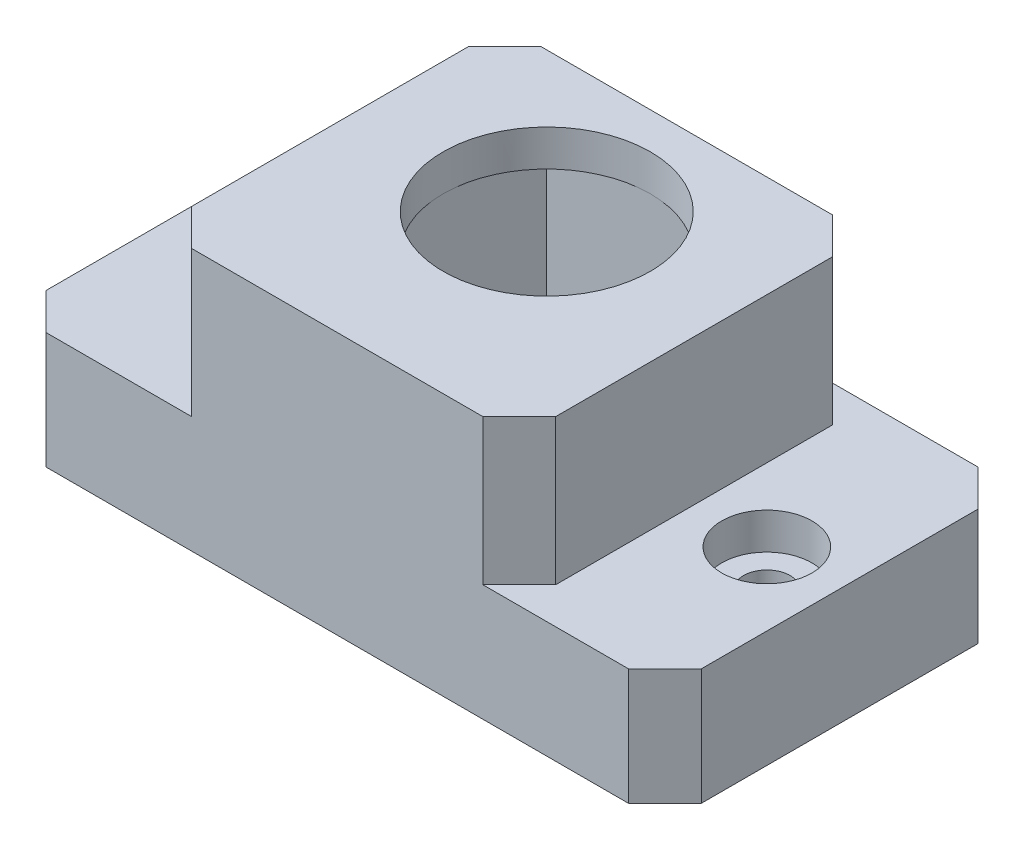
ISO-10303-21;
HEADER;
FILE_DESCRIPTION(('STEP AP214'),'2;1');
FILE_NAME('part.step','',(''),(''),'','','');
FILE_SCHEMA(('AUTOMOTIVE_DESIGN { 1 0 10303 214 1 1 1 1 }'));
ENDSEC;
DATA;
#1=APPLICATION_CONTEXT('core data for automotive mechanical design processes');
#2=APPLICATION_PROTOCOL_DEFINITION('international standard','automotive_design',2000,#1);
#3=PRODUCT_CONTEXT('',#1,'mechanical');
#4=PRODUCT('Part','Part','',(#3));
#5=PRODUCT_RELATED_PRODUCT_CATEGORY('part','',(#4));
#6=PRODUCT_DEFINITION_FORMATION('','',#4);
#7=PRODUCT_DEFINITION_CONTEXT('part definition',#1,'design');
#8=PRODUCT_DEFINITION('design','',#6,#7);
#9=PRODUCT_DEFINITION_SHAPE('','',#8);
#10=(LENGTH_UNIT() NAMED_UNIT(*) SI_UNIT(.MILLI.,.METRE.));
#11=(NAMED_UNIT(*) PLANE_ANGLE_UNIT() SI_UNIT($,.RADIAN.));
#12=(NAMED_UNIT(*) SI_UNIT($,.STERADIAN.) SOLID_ANGLE_UNIT());
#13=UNCERTAINTY_MEASURE_WITH_UNIT(LENGTH_MEASURE(1.E-05),#10,'distance_accuracy_value','');
#14=(GEOMETRIC_REPRESENTATION_CONTEXT(3) GLOBAL_UNCERTAINTY_ASSIGNED_CONTEXT((#13)) GLOBAL_UNIT_ASSIGNED_CONTEXT((#10,
#11,#12)) REPRESENTATION_CONTEXT('',''));
#15=CARTESIAN_POINT('',(0.,0.,0.));
#16=DIRECTION('',(0.,0.,1.));
#17=DIRECTION('',(1.,0.,0.));
#18=AXIS2_PLACEMENT_3D('',#15,#16,#17);
#19=CARTESIAN_POINT('',(0.,15.5,0.));
#20=DIRECTION('',(0.,-1.,0.));
#21=DIRECTION('',(0.,0.,-1.));
#22=AXIS2_PLACEMENT_3D('',#19,#20,#21);
#23=PLANE('',#22);
#24=CARTESIAN_POINT('',(0.,15.5,-2.385));
#25=DIRECTION('',(0.,-1.,0.));
#26=DIRECTION('',(0.,0.,-1.));
#27=AXIS2_PLACEMENT_3D('',#24,#25,#26);
#28=CIRCLE('',#27,7.115);
#29=CARTESIAN_POINT('',(0.,15.5,-9.5));
#30=VERTEX_POINT('',#29);
#31=CARTESIAN_POINT('',(7.115,15.5,-2.385));
#32=VERTEX_POINT('',#31);
#33=EDGE_CURVE('E208',#30,#32,#28,.T.);
#34=ORIENTED_EDGE('',*,*,#33,.F.);
#35=DIRECTION('',(1.,0.,0.));
#36=VECTOR('',#35,1.);
#37=CARTESIAN_POINT('',(0.,15.5,-9.5));
#38=LINE('',#37,#36);
#39=CARTESIAN_POINT('',(7.115,15.5,-9.5));
#40=VERTEX_POINT('',#39);
#41=EDGE_CURVE('E219',#30,#40,#38,.T.);
#42=ORIENTED_EDGE('',*,*,#41,.T.);
#43=DIRECTION('',(0.,0.,-1.));
#44=VECTOR('',#43,1.);
#45=CARTESIAN_POINT('',(7.115,15.5,0.));
#46=LINE('',#45,#44);
#47=EDGE_CURVE('E221',#32,#40,#46,.T.);
#48=ORIENTED_EDGE('',*,*,#47,.F.);
#49=EDGE_LOOP('',(#34,#42,#48));
#50=FACE_BOUND('',#49,.T.);
#51=ADVANCED_FACE('F59',(#50),#23,.T.);
#52=CARTESIAN_POINT('',(-7.115,15.5,-2.385));
#53=VERTEX_POINT('',#52);
#54=EDGE_CURVE('E210',#32,#53,#28,.T.);
#55=ORIENTED_EDGE('',*,*,#54,.F.);
#56=CARTESIAN_POINT('',(7.115,15.5,9.5));
#57=VERTEX_POINT('',#56);
#58=EDGE_CURVE('E235',#57,#32,#46,.T.);
#59=ORIENTED_EDGE('',*,*,#58,.F.);
#60=DIRECTION('',(1.,0.,0.));
#61=VECTOR('',#60,1.);
#62=CARTESIAN_POINT('',(0.,15.5,9.5));
#63=LINE('',#62,#61);
#64=CARTESIAN_POINT('',(-7.115,15.5,9.5));
#65=VERTEX_POINT('',#64);
#66=EDGE_CURVE('E768',#65,#57,#63,.T.);
#67=ORIENTED_EDGE('',*,*,#66,.F.);
#68=DIRECTION('',(0.,0.,-1.));
#69=VECTOR('',#68,1.);
#70=CARTESIAN_POINT('',(-7.115,15.5,0.));
#71=LINE('',#70,#69);
#72=EDGE_CURVE('E254',#65,#53,#71,.T.);
#73=ORIENTED_EDGE('',*,*,#72,.T.);
#74=EDGE_LOOP('',(#55,#59,#67,#73));
#75=FACE_BOUND('',#74,.T.);
#76=ADVANCED_FACE('F431',(#75),#23,.T.);
#77=CARTESIAN_POINT('',(-17.5,0.,0.));
#78=DIRECTION('',(0.,1.,0.));
#79=DIRECTION('',(0.,0.,1.));
#80=AXIS2_PLACEMENT_3D('',#77,#78,#79);
#81=CYLINDRICAL_SURFACE('',#80,1.6);
#82=CARTESIAN_POINT('',(-17.5,0.,0.));
#83=DIRECTION('',(0.,1.,0.));
#84=DIRECTION('',(0.,0.,1.));
#85=AXIS2_PLACEMENT_3D('',#82,#83,#84);
#86=CIRCLE('',#85,1.6);
#87=CARTESIAN_POINT('',(-17.5,0.,1.6));
#88=VERTEX_POINT('',#87);
#89=EDGE_CURVE('E255',#88,#88,#86,.T.);
#90=ORIENTED_EDGE('',*,*,#89,.F.);
#91=EDGE_LOOP('',(#90));
#92=FACE_BOUND('',#91,.T.);
#93=CARTESIAN_POINT('',(-17.5,5.5,0.));
#94=DIRECTION('',(0.,1.,0.));
#95=DIRECTION('',(0.,0.,1.));
#96=AXIS2_PLACEMENT_3D('',#93,#94,#95);
#97=CIRCLE('',#96,1.6);
#98=CARTESIAN_POINT('',(-17.5,5.5,1.6));
#99=VERTEX_POINT('',#98);
#100=EDGE_CURVE('E262',#99,#99,#97,.F.);
#101=ORIENTED_EDGE('',*,*,#100,.F.);
#102=EDGE_LOOP('',(#101));
#103=FACE_BOUND('',#102,.T.);
#104=ADVANCED_FACE('F436',(#92,#103),#81,.F.);
#105=CARTESIAN_POINT('',(17.5,0.,0.));
#106=DIRECTION('',(0.,1.,0.));
#107=DIRECTION('',(0.,0.,1.));
#108=AXIS2_PLACEMENT_3D('',#105,#106,#107);
#109=CYLINDRICAL_SURFACE('',#108,1.6);
#110=CARTESIAN_POINT('',(17.5,0.,0.));
#111=DIRECTION('',(0.,1.,0.));
#112=DIRECTION('',(0.,0.,1.));
#113=AXIS2_PLACEMENT_3D('',#110,#111,#112);
#114=CIRCLE('',#113,1.6);
#115=CARTESIAN_POINT('',(17.5,0.,1.6));
#116=VERTEX_POINT('',#115);
#117=EDGE_CURVE('E259',#116,#116,#114,.T.);
#118=ORIENTED_EDGE('',*,*,#117,.F.);
#119=EDGE_LOOP('',(#118));
#120=FACE_BOUND('',#119,.T.);
#121=CARTESIAN_POINT('',(17.5,5.5,0.));
#122=DIRECTION('',(0.,1.,0.));
#123=DIRECTION('',(0.,0.,1.));
#124=AXIS2_PLACEMENT_3D('',#121,#122,#123);
#125=CIRCLE('',#124,1.6);
#126=CARTESIAN_POINT('',(17.5,5.5,1.6));
#127=VERTEX_POINT('',#126);
#128=EDGE_CURVE('E244',#127,#127,#125,.F.);
#129=ORIENTED_EDGE('',*,*,#128,.F.);
#130=EDGE_LOOP('',(#129));
#131=FACE_BOUND('',#130,.T.);
#132=ADVANCED_FACE('F468',(#120,#131),#109,.F.);
#133=CARTESIAN_POINT('',(-22.5,18.,-12.));
#134=DIRECTION('',(1.,0.,0.));
#135=DIRECTION('',(0.,0.,-1.));
#136=AXIS2_PLACEMENT_3D('',#133,#134,#135);
#137=PLANE('',#136);
#138=DIRECTION('',(0.,0.,1.));
#139=VECTOR('',#138,1.);
#140=CARTESIAN_POINT('',(-22.5,0.,-12.));
#141=LINE('',#140,#139);
#142=CARTESIAN_POINT('',(-22.5,0.,-9.5));
#143=VERTEX_POINT('',#142);
#144=CARTESIAN_POINT('',(-22.5,0.,9.49999999999999));
#145=VERTEX_POINT('',#144);
#146=EDGE_CURVE('E272',#143,#145,#141,.T.);
#147=ORIENTED_EDGE('',*,*,#146,.T.);
#148=DIRECTION('',(0.,1.,0.));
#149=VECTOR('',#148,1.);
#150=CARTESIAN_POINT('',(-22.5,18.,9.49999999999999));
#151=LINE('',#150,#149);
#152=CARTESIAN_POINT('',(-22.5,8.,9.49999999999999));
#153=VERTEX_POINT('',#152);
#154=EDGE_CURVE('E74',#145,#153,#151,.T.);
#155=ORIENTED_EDGE('',*,*,#154,.T.);
#156=DIRECTION('',(0.,0.,1.));
#157=VECTOR('',#156,1.);
#158=CARTESIAN_POINT('',(-22.5,8.,-12.));
#159=LINE('',#158,#157);
#160=CARTESIAN_POINT('',(-22.5,8.,-9.5));
#161=VERTEX_POINT('',#160);
#162=EDGE_CURVE('E270',#161,#153,#159,.T.);
#163=ORIENTED_EDGE('',*,*,#162,.F.);
#164=DIRECTION('',(0.,-1.,0.));
#165=VECTOR('',#164,1.);
#166=CARTESIAN_POINT('',(-22.5,18.,-9.5));
#167=LINE('',#166,#165);
#168=EDGE_CURVE('E366',#161,#143,#167,.T.);
#169=ORIENTED_EDGE('',*,*,#168,.T.);
#170=EDGE_LOOP('',(#147,#155,#163,#169));
#171=FACE_BOUND('',#170,.T.);
#172=ADVANCED_FACE('F471',(#171),#137,.F.);
#173=CARTESIAN_POINT('',(22.5,18.,12.));
#174=DIRECTION('',(0.,0.,-1.));
#175=DIRECTION('',(-1.,0.,0.));
#176=AXIS2_PLACEMENT_3D('',#173,#174,#175);
#177=PLANE('',#176);
#178=DIRECTION('',(1.,0.,0.));
#179=VECTOR('',#178,1.);
#180=CARTESIAN_POINT('',(22.5,8.,12.));
#181=LINE('',#180,#179);
#182=CARTESIAN_POINT('',(10.,8.,12.));
#183=VERTEX_POINT('',#182);
#184=CARTESIAN_POINT('',(20.,8.,12.));
#185=VERTEX_POINT('',#184);
#186=EDGE_CURVE('E284',#183,#185,#181,.T.);
#187=ORIENTED_EDGE('',*,*,#186,.F.);
#188=DIRECTION('',(0.,1.,0.));
#189=VECTOR('',#188,1.);
#190=CARTESIAN_POINT('',(10.,18.,12.));
#191=LINE('',#190,#189);
#192=CARTESIAN_POINT('',(10.,18.,12.));
#193=VERTEX_POINT('',#192);
#194=EDGE_CURVE('E317',#183,#193,#191,.T.);
#195=ORIENTED_EDGE('',*,*,#194,.T.);
#196=DIRECTION('',(1.,0.,0.));
#197=VECTOR('',#196,1.);
#198=CARTESIAN_POINT('',(22.5,18.,12.));
#199=LINE('',#198,#197);
#200=CARTESIAN_POINT('',(-9.99999999999997,18.,12.));
#201=VERTEX_POINT('',#200);
#202=EDGE_CURVE('E289',#201,#193,#199,.T.);
#203=ORIENTED_EDGE('',*,*,#202,.F.);
#204=DIRECTION('',(0.,-1.,0.));
#205=VECTOR('',#204,1.);
#206=CARTESIAN_POINT('',(-9.99999999999999,18.,12.));
#207=LINE('',#206,#205);
#208=CARTESIAN_POINT('',(-9.99999999999999,8.,12.));
#209=VERTEX_POINT('',#208);
#210=EDGE_CURVE('E314',#201,#209,#207,.T.);
#211=ORIENTED_EDGE('',*,*,#210,.T.);
#212=DIRECTION('',(1.,0.,0.));
#213=VECTOR('',#212,1.);
#214=CARTESIAN_POINT('',(-22.5,8.,12.));
#215=LINE('',#214,#213);
#216=CARTESIAN_POINT('',(-20.,8.,12.));
#217=VERTEX_POINT('',#216);
#218=EDGE_CURVE('E266',#217,#209,#215,.T.);
#219=ORIENTED_EDGE('',*,*,#218,.F.);
#220=DIRECTION('',(0.,-1.,0.));
#221=VECTOR('',#220,1.);
#222=CARTESIAN_POINT('',(-20.,18.,12.));
#223=LINE('',#222,#221);
#224=CARTESIAN_POINT('',(-20.,0.,12.));
#225=VERTEX_POINT('',#224);
#226=EDGE_CURVE('E296',#217,#225,#223,.T.);
#227=ORIENTED_EDGE('',*,*,#226,.T.);
#228=DIRECTION('',(1.,0.,0.));
#229=VECTOR('',#228,1.);
#230=CARTESIAN_POINT('',(22.5,0.,12.));
#231=LINE('',#230,#229);
#232=CARTESIAN_POINT('',(20.,0.,12.));
#233=VERTEX_POINT('',#232);
#234=EDGE_CURVE('E298',#225,#233,#231,.T.);
#235=ORIENTED_EDGE('',*,*,#234,.T.);
#236=DIRECTION('',(0.,1.,0.));
#237=VECTOR('',#236,1.);
#238=CARTESIAN_POINT('',(20.,18.,12.));
#239=LINE('',#238,#237);
#240=EDGE_CURVE('E312',#233,#185,#239,.T.);
#241=ORIENTED_EDGE('',*,*,#240,.T.);
#242=EDGE_LOOP('',(#187,#195,#203,#211,#219,#227,#235,#241));
#243=FACE_BOUND('',#242,.T.);
#244=ADVANCED_FACE('F409',(#243),#177,.F.);
#245=CARTESIAN_POINT('',(22.5,18.,-12.));
#246=DIRECTION('',(-1.,0.,0.));
#247=DIRECTION('',(0.,0.,1.));
#248=AXIS2_PLACEMENT_3D('',#245,#246,#247);
#249=PLANE('',#248);
#250=DIRECTION('',(0.,0.,-1.));
#251=VECTOR('',#250,1.);
#252=CARTESIAN_POINT('',(22.5,8.,-12.));
#253=LINE('',#252,#251);
#254=CARTESIAN_POINT('',(22.5,8.,9.49999999999999));
#255=VERTEX_POINT('',#254);
#256=CARTESIAN_POINT('',(22.5,8.,-9.49999999999999));
#257=VERTEX_POINT('',#256);
#258=EDGE_CURVE('E267',#255,#257,#253,.T.);
#259=ORIENTED_EDGE('',*,*,#258,.F.);
#260=DIRECTION('',(0.,-1.,0.));
#261=VECTOR('',#260,1.);
#262=CARTESIAN_POINT('',(22.5,18.,9.49999999999999));
#263=LINE('',#262,#261);
#264=CARTESIAN_POINT('',(22.5,0.,9.49999999999999));
#265=VERTEX_POINT('',#264);
#266=EDGE_CURVE('E351',#255,#265,#263,.T.);
#267=ORIENTED_EDGE('',*,*,#266,.T.);
#268=DIRECTION('',(0.,0.,-1.));
#269=VECTOR('',#268,1.);
#270=CARTESIAN_POINT('',(22.5,0.,-12.));
#271=LINE('',#270,#269);
#272=CARTESIAN_POINT('',(22.5,0.,-9.49999999999999));
#273=VERTEX_POINT('',#272);
#274=EDGE_CURVE('E301',#265,#273,#271,.T.);
#275=ORIENTED_EDGE('',*,*,#274,.T.);
#276=DIRECTION('',(0.,1.,0.));
#277=VECTOR('',#276,1.);
#278=CARTESIAN_POINT('',(22.5,18.,-9.49999999999999));
#279=LINE('',#278,#277);
#280=EDGE_CURVE('E349',#273,#257,#279,.T.);
#281=ORIENTED_EDGE('',*,*,#280,.T.);
#282=EDGE_LOOP('',(#259,#267,#275,#281));
#283=FACE_BOUND('',#282,.T.);
#284=ADVANCED_FACE('F493',(#283),#249,.F.);
#285=CARTESIAN_POINT('',(22.5,18.,-12.));
#286=DIRECTION('',(0.,0.,1.));
#287=DIRECTION('',(1.,0.,0.));
#288=AXIS2_PLACEMENT_3D('',#285,#286,#287);
#289=PLANE('',#288);
#290=DIRECTION('',(-1.,0.,0.));
#291=VECTOR('',#290,1.);
#292=CARTESIAN_POINT('',(-22.5,8.,-12.));
#293=LINE('',#292,#291);
#294=CARTESIAN_POINT('',(-9.99999999999998,8.,-12.));
#295=VERTEX_POINT('',#294);
#296=CARTESIAN_POINT('',(-20.,8.,-12.));
#297=VERTEX_POINT('',#296);
#298=EDGE_CURVE('E273',#295,#297,#293,.T.);
#299=ORIENTED_EDGE('',*,*,#298,.F.);
#300=DIRECTION('',(0.,1.,0.));
#301=VECTOR('',#300,1.);
#302=CARTESIAN_POINT('',(-9.99999999999998,18.,-12.));
#303=LINE('',#302,#301);
#304=CARTESIAN_POINT('',(-9.99999999999997,18.,-12.));
#305=VERTEX_POINT('',#304);
#306=EDGE_CURVE('E346',#295,#305,#303,.T.);
#307=ORIENTED_EDGE('',*,*,#306,.T.);
#308=DIRECTION('',(-1.,0.,0.));
#309=VECTOR('',#308,1.);
#310=CARTESIAN_POINT('',(22.5,18.,-12.));
#311=LINE('',#310,#309);
#312=CARTESIAN_POINT('',(9.99999999999999,18.,-12.));
#313=VERTEX_POINT('',#312);
#314=EDGE_CURVE('E292',#313,#305,#311,.T.);
#315=ORIENTED_EDGE('',*,*,#314,.F.);
#316=DIRECTION('',(0.,-1.,0.));
#317=VECTOR('',#316,1.);
#318=CARTESIAN_POINT('',(9.99999999999999,18.,-12.));
#319=LINE('',#318,#317);
#320=CARTESIAN_POINT('',(9.99999999999999,8.,-12.));
#321=VERTEX_POINT('',#320);
#322=EDGE_CURVE('E343',#313,#321,#319,.T.);
#323=ORIENTED_EDGE('',*,*,#322,.T.);
#324=DIRECTION('',(-1.,0.,0.));
#325=VECTOR('',#324,1.);
#326=CARTESIAN_POINT('',(22.5,8.,-12.));
#327=LINE('',#326,#325);
#328=CARTESIAN_POINT('',(20.,8.,-12.));
#329=VERTEX_POINT('',#328);
#330=EDGE_CURVE('E279',#329,#321,#327,.T.);
#331=ORIENTED_EDGE('',*,*,#330,.F.);
#332=DIRECTION('',(0.,-1.,0.));
#333=VECTOR('',#332,1.);
#334=CARTESIAN_POINT('',(20.,18.,-12.));
#335=LINE('',#334,#333);
#336=CARTESIAN_POINT('',(20.,0.,-12.));
#337=VERTEX_POINT('',#336);
#338=EDGE_CURVE('E338',#329,#337,#335,.T.);
#339=ORIENTED_EDGE('',*,*,#338,.T.);
#340=DIRECTION('',(-1.,0.,0.));
#341=VECTOR('',#340,1.);
#342=CARTESIAN_POINT('',(22.5,0.,-12.));
#343=LINE('',#342,#341);
#344=CARTESIAN_POINT('',(-20.,0.,-12.));
#345=VERTEX_POINT('',#344);
#346=EDGE_CURVE('E293',#337,#345,#343,.T.);
#347=ORIENTED_EDGE('',*,*,#346,.T.);
#348=DIRECTION('',(0.,1.,0.));
#349=VECTOR('',#348,1.);
#350=CARTESIAN_POINT('',(-20.,18.,-12.));
#351=LINE('',#350,#349);
#352=EDGE_CURVE('E341',#345,#297,#351,.T.);
#353=ORIENTED_EDGE('',*,*,#352,.T.);
#354=EDGE_LOOP('',(#299,#307,#315,#323,#331,#339,#347,#353));
#355=FACE_BOUND('',#354,.T.);
#356=ADVANCED_FACE('F387',(#355),#289,.F.);
#357=CARTESIAN_POINT('',(0.,18.,0.));
#358=DIRECTION('',(0.,-1.,0.));
#359=DIRECTION('',(0.,0.,-1.));
#360=AXIS2_PLACEMENT_3D('',#357,#358,#359);
#361=PLANE('',#360);
#362=CARTESIAN_POINT('',(0.,18.,-2.385));
#363=DIRECTION('',(0.,-1.,0.));
#364=DIRECTION('',(0.,0.,-1.));
#365=AXIS2_PLACEMENT_3D('',#362,#363,#364);
#366=CIRCLE('',#365,7.115);
#367=CARTESIAN_POINT('',(0.,18.,-9.5));
#368=VERTEX_POINT('',#367);
#369=EDGE_CURVE('E223',#368,#368,#366,.T.);
#370=ORIENTED_EDGE('',*,*,#369,.T.);
#371=EDGE_LOOP('',(#370));
#372=FACE_BOUND('',#371,.T.);
#373=ORIENTED_EDGE('',*,*,#202,.T.);
#374=DIRECTION('',(-0.707106781186546,0.,0.707106781186549));
#375=VECTOR('',#374,1.);
#376=CARTESIAN_POINT('',(10.,18.,12.));
#377=LINE('',#376,#375);
#378=CARTESIAN_POINT('',(12.5,18.,9.49999999999999));
#379=VERTEX_POINT('',#378);
#380=EDGE_CURVE('E326',#193,#379,#377,.F.);
#381=ORIENTED_EDGE('',*,*,#380,.T.);
#382=DIRECTION('',(0.,0.,1.));
#383=VECTOR('',#382,1.);
#384=CARTESIAN_POINT('',(12.5,18.,-12.));
#385=LINE('',#384,#383);
#386=CARTESIAN_POINT('',(12.5,18.,-9.5));
#387=VERTEX_POINT('',#386);
#388=EDGE_CURVE('E258',#387,#379,#385,.T.);
#389=ORIENTED_EDGE('',*,*,#388,.F.);
#390=DIRECTION('',(0.707106781186549,0.,0.707106781186546));
#391=VECTOR('',#390,1.);
#392=CARTESIAN_POINT('',(12.5,18.,-9.5));
#393=LINE('',#392,#391);
#394=EDGE_CURVE('E320',#387,#313,#393,.F.);
#395=ORIENTED_EDGE('',*,*,#394,.T.);
#396=ORIENTED_EDGE('',*,*,#314,.T.);
#397=DIRECTION('',(0.707106781186547,0.,-0.707106781186548));
#398=VECTOR('',#397,1.);
#399=CARTESIAN_POINT('',(-9.99999999999998,18.,-12.));
#400=LINE('',#399,#398);
#401=CARTESIAN_POINT('',(-12.5,18.,-9.49999999999998));
#402=VERTEX_POINT('',#401);
#403=EDGE_CURVE('E322',#305,#402,#400,.F.);
#404=ORIENTED_EDGE('',*,*,#403,.T.);
#405=DIRECTION('',(0.,0.,-1.));
#406=VECTOR('',#405,1.);
#407=CARTESIAN_POINT('',(-12.5,18.,-12.));
#408=LINE('',#407,#406);
#409=CARTESIAN_POINT('',(-12.5,18.,9.50000000000001));
#410=VERTEX_POINT('',#409);
#411=EDGE_CURVE('E263',#410,#402,#408,.T.);
#412=ORIENTED_EDGE('',*,*,#411,.F.);
#413=DIRECTION('',(-0.70710678118655,0.,-0.707106781186545));
#414=VECTOR('',#413,1.);
#415=CARTESIAN_POINT('',(-12.5,18.,9.50000000000001));
#416=LINE('',#415,#414);
#417=EDGE_CURVE('E324',#410,#201,#416,.F.);
#418=ORIENTED_EDGE('',*,*,#417,.T.);
#419=EDGE_LOOP('',(#373,#381,#389,#395,#396,#404,#412,#418));
#420=FACE_BOUND('',#419,.T.);
#421=ADVANCED_FACE('F390',(#372,#420),#361,.F.);
#422=CARTESIAN_POINT('',(0.,0.,0.));
#423=DIRECTION('',(0.,-1.,0.));
#424=DIRECTION('',(0.,0.,-1.));
#425=AXIS2_PLACEMENT_3D('',#422,#423,#424);
#426=PLANE('',#425);
#427=DIRECTION('',(-1.,0.,0.));
#428=VECTOR('',#427,1.);
#429=CARTESIAN_POINT('',(0.,0.,9.5));
#430=LINE('',#429,#428);
#431=CARTESIAN_POINT('',(7.115,0.,9.5));
#432=VERTEX_POINT('',#431);
#433=CARTESIAN_POINT('',(-7.115,0.,9.5));
#434=VERTEX_POINT('',#433);
#435=EDGE_CURVE('E755',#432,#434,#430,.T.);
#436=ORIENTED_EDGE('',*,*,#435,.F.);
#437=DIRECTION('',(0.,0.,1.));
#438=VECTOR('',#437,1.);
#439=CARTESIAN_POINT('',(7.115,0.,0.));
#440=LINE('',#439,#438);
#441=CARTESIAN_POINT('',(7.115,0.,-9.5));
#442=VERTEX_POINT('',#441);
#443=EDGE_CURVE('E758',#442,#432,#440,.T.);
#444=ORIENTED_EDGE('',*,*,#443,.F.);
#445=DIRECTION('',(-1.,0.,0.));
#446=VECTOR('',#445,1.);
#447=CARTESIAN_POINT('',(0.,0.,-9.5));
#448=LINE('',#447,#446);
#449=CARTESIAN_POINT('',(-7.115,0.,-9.5));
#450=VERTEX_POINT('',#449);
#451=EDGE_CURVE('E756',#442,#450,#448,.T.);
#452=ORIENTED_EDGE('',*,*,#451,.T.);
#453=DIRECTION('',(0.,0.,1.));
#454=VECTOR('',#453,1.);
#455=CARTESIAN_POINT('',(-7.115,0.,0.));
#456=LINE('',#455,#454);
#457=EDGE_CURVE('E746',#450,#434,#456,.T.);
#458=ORIENTED_EDGE('',*,*,#457,.T.);
#459=EDGE_LOOP('',(#436,#444,#452,#458));
#460=FACE_BOUND('',#459,.T.);
#461=ORIENTED_EDGE('',*,*,#89,.T.);
#462=EDGE_LOOP('',(#461));
#463=FACE_BOUND('',#462,.T.);
#464=ORIENTED_EDGE('',*,*,#117,.T.);
#465=EDGE_LOOP('',(#464));
#466=FACE_BOUND('',#465,.T.);
#467=ORIENTED_EDGE('',*,*,#274,.F.);
#468=DIRECTION('',(0.707106781186549,0.,-0.707106781186546));
#469=VECTOR('',#468,1.);
#470=CARTESIAN_POINT('',(16.,0.,16.));
#471=LINE('',#470,#469);
#472=EDGE_CURVE('E360',#265,#233,#471,.F.);
#473=ORIENTED_EDGE('',*,*,#472,.T.);
#474=ORIENTED_EDGE('',*,*,#234,.F.);
#475=DIRECTION('',(0.707106781186547,0.,0.707106781186548));
#476=VECTOR('',#475,1.);
#477=CARTESIAN_POINT('',(-16.,0.,16.));
#478=LINE('',#477,#476);
#479=EDGE_CURVE('E358',#225,#145,#478,.F.);
#480=ORIENTED_EDGE('',*,*,#479,.T.);
#481=ORIENTED_EDGE('',*,*,#146,.F.);
#482=DIRECTION('',(-0.707106781186549,0.,0.707106781186547));
#483=VECTOR('',#482,1.);
#484=CARTESIAN_POINT('',(-16.,0.,-16.));
#485=LINE('',#484,#483);
#486=EDGE_CURVE('E356',#143,#345,#485,.F.);
#487=ORIENTED_EDGE('',*,*,#486,.T.);
#488=ORIENTED_EDGE('',*,*,#346,.F.);
#489=DIRECTION('',(-0.707106781186547,0.,-0.707106781186549));
#490=VECTOR('',#489,1.);
#491=CARTESIAN_POINT('',(16.,0.,-16.));
#492=LINE('',#491,#490);
#493=EDGE_CURVE('E354',#337,#273,#492,.F.);
#494=ORIENTED_EDGE('',*,*,#493,.T.);
#495=EDGE_LOOP('',(#467,#473,#474,#480,#481,#487,#488,#494));
#496=FACE_BOUND('',#495,.T.);
#497=ADVANCED_FACE('F482',(#460,#463,#466,#496),#426,.T.);
#498=CARTESIAN_POINT('',(0.,8.,0.));
#499=DIRECTION('',(0.,-1.,0.));
#500=DIRECTION('',(0.,0.,-1.));
#501=AXIS2_PLACEMENT_3D('',#498,#499,#500);
#502=PLANE('',#501);
#503=CARTESIAN_POINT('',(17.5,8.,0.));
#504=DIRECTION('',(0.,1.,0.));
#505=DIRECTION('',(0.,0.,1.));
#506=AXIS2_PLACEMENT_3D('',#503,#504,#505);
#507=CIRCLE('',#506,3.1);
#508=CARTESIAN_POINT('',(17.5,8.,3.1));
#509=VERTEX_POINT('',#508);
#510=EDGE_CURVE('E251',#509,#509,#507,.T.);
#511=ORIENTED_EDGE('',*,*,#510,.F.);
#512=EDGE_LOOP('',(#511));
#513=FACE_BOUND('',#512,.T.);
#514=ORIENTED_EDGE('',*,*,#186,.T.);
#515=DIRECTION('',(-0.707106781186549,0.,0.707106781186546));
#516=VECTOR('',#515,1.);
#517=CARTESIAN_POINT('',(22.5,8.,9.49999999999999));
#518=LINE('',#517,#516);
#519=EDGE_CURVE('E364',#185,#255,#518,.F.);
#520=ORIENTED_EDGE('',*,*,#519,.T.);
#521=ORIENTED_EDGE('',*,*,#258,.T.);
#522=DIRECTION('',(0.707106781186547,0.,0.707106781186549));
#523=VECTOR('',#522,1.);
#524=CARTESIAN_POINT('',(20.,8.,-12.));
#525=LINE('',#524,#523);
#526=EDGE_CURVE('E362',#257,#329,#525,.F.);
#527=ORIENTED_EDGE('',*,*,#526,.T.);
#528=ORIENTED_EDGE('',*,*,#330,.T.);
#529=DIRECTION('',(-0.707106781186549,0.,-0.707106781186546));
#530=VECTOR('',#529,1.);
#531=CARTESIAN_POINT('',(11.,8.,-11.));
#532=LINE('',#531,#530);
#533=CARTESIAN_POINT('',(12.5,8.,-9.5));
#534=VERTEX_POINT('',#533);
#535=EDGE_CURVE('E13',#321,#534,#532,.F.);
#536=ORIENTED_EDGE('',*,*,#535,.T.);
#537=DIRECTION('',(0.,0.,1.));
#538=VECTOR('',#537,1.);
#539=CARTESIAN_POINT('',(12.5,8.,-12.));
#540=LINE('',#539,#538);
#541=CARTESIAN_POINT('',(12.5,8.,9.49999999999999));
#542=VERTEX_POINT('',#541);
#543=EDGE_CURVE('E281',#534,#542,#540,.T.);
#544=ORIENTED_EDGE('',*,*,#543,.T.);
#545=DIRECTION('',(0.707106781186546,0.,-0.707106781186549));
#546=VECTOR('',#545,1.);
#547=CARTESIAN_POINT('',(11.,8.,11.));
#548=LINE('',#547,#546);
#549=EDGE_CURVE('E373',#542,#183,#548,.F.);
#550=ORIENTED_EDGE('',*,*,#549,.T.);
#551=EDGE_LOOP('',(#514,#520,#521,#527,#528,#536,#544,#550));
#552=FACE_BOUND('',#551,.T.);
#553=ADVANCED_FACE('F403',(#513,#552),#502,.F.);
#554=CARTESIAN_POINT('',(12.5,-26.,-12.));
#555=DIRECTION('',(-1.,0.,0.));
#556=DIRECTION('',(0.,0.,1.));
#557=AXIS2_PLACEMENT_3D('',#554,#555,#556);
#558=PLANE('',#557);
#559=ORIENTED_EDGE('',*,*,#388,.T.);
#560=DIRECTION('',(0.,-1.,0.));
#561=VECTOR('',#560,1.);
#562=CARTESIAN_POINT('',(12.5,-26.,9.49999999999999));
#563=LINE('',#562,#561);
#564=EDGE_CURVE('E331',#379,#542,#563,.T.);
#565=ORIENTED_EDGE('',*,*,#564,.T.);
#566=ORIENTED_EDGE('',*,*,#543,.F.);
#567=DIRECTION('',(0.,1.,0.));
#568=VECTOR('',#567,1.);
#569=CARTESIAN_POINT('',(12.5,-26.,-9.5));
#570=LINE('',#569,#568);
#571=EDGE_CURVE('E328',#534,#387,#570,.T.);
#572=ORIENTED_EDGE('',*,*,#571,.T.);
#573=EDGE_LOOP('',(#559,#565,#566,#572));
#574=FACE_BOUND('',#573,.T.);
#575=ADVANCED_FACE('F399',(#574),#558,.F.);
#576=CARTESIAN_POINT('',(0.,8.,0.));
#577=DIRECTION('',(0.,-1.,0.));
#578=DIRECTION('',(0.,0.,-1.));
#579=AXIS2_PLACEMENT_3D('',#576,#577,#578);
#580=PLANE('',#579);
#581=CARTESIAN_POINT('',(-17.5,8.,0.));
#582=DIRECTION('',(0.,1.,0.));
#583=DIRECTION('',(0.,0.,1.));
#584=AXIS2_PLACEMENT_3D('',#581,#582,#583);
#585=CIRCLE('',#584,3.1);
#586=CARTESIAN_POINT('',(-17.5,8.,3.1));
#587=VERTEX_POINT('',#586);
#588=EDGE_CURVE('E245',#587,#587,#585,.T.);
#589=ORIENTED_EDGE('',*,*,#588,.F.);
#590=EDGE_LOOP('',(#589));
#591=FACE_BOUND('',#590,.T.);
#592=ORIENTED_EDGE('',*,*,#162,.T.);
#593=DIRECTION('',(-0.707106781186547,0.,-0.707106781186548));
#594=VECTOR('',#593,1.);
#595=CARTESIAN_POINT('',(-20.,8.,12.));
#596=LINE('',#595,#594);
#597=EDGE_CURVE('E371',#153,#217,#596,.F.);
#598=ORIENTED_EDGE('',*,*,#597,.T.);
#599=ORIENTED_EDGE('',*,*,#218,.T.);
#600=DIRECTION('',(0.70710678118655,0.,0.707106781186545));
#601=VECTOR('',#600,1.);
#602=CARTESIAN_POINT('',(-11.,8.,11.));
#603=LINE('',#602,#601);
#604=CARTESIAN_POINT('',(-12.5,8.,9.50000000000001));
#605=VERTEX_POINT('',#604);
#606=EDGE_CURVE('E376',#209,#605,#603,.F.);
#607=ORIENTED_EDGE('',*,*,#606,.T.);
#608=DIRECTION('',(0.,0.,-1.));
#609=VECTOR('',#608,1.);
#610=CARTESIAN_POINT('',(-12.5,8.,-12.));
#611=LINE('',#610,#609);
#612=CARTESIAN_POINT('',(-12.5,8.,-9.49999999999998));
#613=VERTEX_POINT('',#612);
#614=EDGE_CURVE('E269',#605,#613,#611,.T.);
#615=ORIENTED_EDGE('',*,*,#614,.T.);
#616=DIRECTION('',(-0.707106781186547,0.,0.707106781186548));
#617=VECTOR('',#616,1.);
#618=CARTESIAN_POINT('',(-11.,8.,-11.));
#619=LINE('',#618,#617);
#620=EDGE_CURVE('E67',#613,#295,#619,.F.);
#621=ORIENTED_EDGE('',*,*,#620,.T.);
#622=ORIENTED_EDGE('',*,*,#298,.T.);
#623=DIRECTION('',(0.707106781186549,0.,-0.707106781186547));
#624=VECTOR('',#623,1.);
#625=CARTESIAN_POINT('',(-22.5,8.,-9.5));
#626=LINE('',#625,#624);
#627=EDGE_CURVE('E81',#297,#161,#626,.F.);
#628=ORIENTED_EDGE('',*,*,#627,.T.);
#629=EDGE_LOOP('',(#592,#598,#599,#607,#615,#621,#622,#628));
#630=FACE_BOUND('',#629,.T.);
#631=ADVANCED_FACE('F380',(#591,#630),#580,.F.);
#632=CARTESIAN_POINT('',(-12.5,-26.,-12.));
#633=DIRECTION('',(1.,0.,0.));
#634=DIRECTION('',(0.,0.,-1.));
#635=AXIS2_PLACEMENT_3D('',#632,#633,#634);
#636=PLANE('',#635);
#637=ORIENTED_EDGE('',*,*,#614,.F.);
#638=DIRECTION('',(0.,1.,0.));
#639=VECTOR('',#638,1.);
#640=CARTESIAN_POINT('',(-12.5,-26.,9.50000000000001));
#641=LINE('',#640,#639);
#642=EDGE_CURVE('E335',#605,#410,#641,.T.);
#643=ORIENTED_EDGE('',*,*,#642,.T.);
#644=ORIENTED_EDGE('',*,*,#411,.T.);
#645=DIRECTION('',(0.,-1.,0.));
#646=VECTOR('',#645,1.);
#647=CARTESIAN_POINT('',(-12.5,-26.,-9.49999999999998));
#648=LINE('',#647,#646);
#649=EDGE_CURVE('E333',#402,#613,#648,.T.);
#650=ORIENTED_EDGE('',*,*,#649,.T.);
#651=EDGE_LOOP('',(#637,#643,#644,#650));
#652=FACE_BOUND('',#651,.T.);
#653=ADVANCED_FACE('F416',(#652),#636,.F.);
#654=CARTESIAN_POINT('',(17.5,5.5,0.));
#655=DIRECTION('',(0.,1.,0.));
#656=DIRECTION('',(0.,0.,1.));
#657=AXIS2_PLACEMENT_3D('',#654,#655,#656);
#658=PLANE('',#657);
#659=CARTESIAN_POINT('',(17.5,5.5,0.));
#660=DIRECTION('',(0.,1.,0.));
#661=DIRECTION('',(0.,0.,1.));
#662=AXIS2_PLACEMENT_3D('',#659,#660,#661);
#663=CIRCLE('',#662,3.1);
#664=CARTESIAN_POINT('',(17.5,5.5,3.1));
#665=VERTEX_POINT('',#664);
#666=EDGE_CURVE('E248',#665,#665,#663,.T.);
#667=ORIENTED_EDGE('',*,*,#666,.T.);
#668=EDGE_LOOP('',(#667));
#669=FACE_BOUND('',#668,.T.);
#670=ORIENTED_EDGE('',*,*,#128,.T.);
#671=EDGE_LOOP('',(#670));
#672=FACE_BOUND('',#671,.T.);
#673=ADVANCED_FACE('F418',(#669,#672),#658,.T.);
#674=CARTESIAN_POINT('',(17.5,5.5,0.));
#675=DIRECTION('',(0.,1.,0.));
#676=DIRECTION('',(0.,0.,1.));
#677=AXIS2_PLACEMENT_3D('',#674,#675,#676);
#678=CYLINDRICAL_SURFACE('',#677,3.1);
#679=ORIENTED_EDGE('',*,*,#666,.F.);
#680=EDGE_LOOP('',(#679));
#681=FACE_BOUND('',#680,.T.);
#682=ORIENTED_EDGE('',*,*,#510,.T.);
#683=EDGE_LOOP('',(#682));
#684=FACE_BOUND('',#683,.T.);
#685=ADVANCED_FACE('F424',(#681,#684),#678,.F.);
#686=CARTESIAN_POINT('',(-17.5,5.5,0.));
#687=DIRECTION('',(0.,1.,0.));
#688=DIRECTION('',(0.,0.,1.));
#689=AXIS2_PLACEMENT_3D('',#686,#687,#688);
#690=PLANE('',#689);
#691=CARTESIAN_POINT('',(-17.5,5.5,0.));
#692=DIRECTION('',(0.,1.,0.));
#693=DIRECTION('',(0.,0.,1.));
#694=AXIS2_PLACEMENT_3D('',#691,#692,#693);
#695=CIRCLE('',#694,3.1);
#696=CARTESIAN_POINT('',(-17.5,5.5,3.1));
#697=VERTEX_POINT('',#696);
#698=EDGE_CURVE('E241',#697,#697,#695,.T.);
#699=ORIENTED_EDGE('',*,*,#698,.T.);
#700=EDGE_LOOP('',(#699));
#701=FACE_BOUND('',#700,.T.);
#702=ORIENTED_EDGE('',*,*,#100,.T.);
#703=EDGE_LOOP('',(#702));
#704=FACE_BOUND('',#703,.T.);
#705=ADVANCED_FACE('F452',(#701,#704),#690,.T.);
#706=CARTESIAN_POINT('',(-17.5,5.5,0.));
#707=DIRECTION('',(0.,1.,0.));
#708=DIRECTION('',(0.,0.,1.));
#709=AXIS2_PLACEMENT_3D('',#706,#707,#708);
#710=CYLINDRICAL_SURFACE('',#709,3.1);
#711=ORIENTED_EDGE('',*,*,#698,.F.);
#712=EDGE_LOOP('',(#711));
#713=FACE_BOUND('',#712,.T.);
#714=ORIENTED_EDGE('',*,*,#588,.T.);
#715=EDGE_LOOP('',(#714));
#716=FACE_BOUND('',#715,.T.);
#717=ADVANCED_FACE('F443',(#713,#716),#710,.F.);
#718=CARTESIAN_POINT('',(0.,41.7380053921976,9.5));
#719=DIRECTION('',(0.,0.,1.));
#720=DIRECTION('',(1.,0.,0.));
#721=AXIS2_PLACEMENT_3D('',#718,#719,#720);
#722=PLANE('',#721);
#723=ORIENTED_EDGE('',*,*,#66,.T.);
#724=DIRECTION('',(0.,-1.,0.));
#725=VECTOR('',#724,1.);
#726=CARTESIAN_POINT('',(7.115,41.7380053921976,9.5));
#727=LINE('',#726,#725);
#728=EDGE_CURVE('E750',#57,#432,#727,.T.);
#729=ORIENTED_EDGE('',*,*,#728,.T.);
#730=ORIENTED_EDGE('',*,*,#435,.T.);
#731=DIRECTION('',(0.,-1.,0.));
#732=VECTOR('',#731,1.);
#733=CARTESIAN_POINT('',(-7.115,41.7380053921976,9.5));
#734=LINE('',#733,#732);
#735=EDGE_CURVE('E231',#65,#434,#734,.T.);
#736=ORIENTED_EDGE('',*,*,#735,.F.);
#737=EDGE_LOOP('',(#723,#729,#730,#736));
#738=FACE_BOUND('',#737,.T.);
#739=ADVANCED_FACE('F442',(#738),#722,.F.);
#740=EDGE_CURVE('E205',#53,#30,#28,.T.);
#741=ORIENTED_EDGE('',*,*,#740,.F.);
#742=CARTESIAN_POINT('',(-7.115,15.5,-9.5));
#743=VERTEX_POINT('',#742);
#744=EDGE_CURVE('E234',#53,#743,#71,.T.);
#745=ORIENTED_EDGE('',*,*,#744,.T.);
#746=EDGE_CURVE('E227',#743,#30,#38,.T.);
#747=ORIENTED_EDGE('',*,*,#746,.T.);
#748=EDGE_LOOP('',(#741,#745,#747));
#749=FACE_BOUND('',#748,.T.);
#750=ADVANCED_FACE('F233',(#749),#23,.T.);
#751=CARTESIAN_POINT('',(7.115,41.7380053921976,0.));
#752=DIRECTION('',(1.,0.,0.));
#753=DIRECTION('',(0.,0.,-1.));
#754=AXIS2_PLACEMENT_3D('',#751,#752,#753);
#755=PLANE('',#754);
#756=ORIENTED_EDGE('',*,*,#58,.T.);
#757=ORIENTED_EDGE('',*,*,#47,.T.);
#758=DIRECTION('',(0.,-1.,0.));
#759=VECTOR('',#758,1.);
#760=CARTESIAN_POINT('',(7.115,41.7380053921976,-9.5));
#761=LINE('',#760,#759);
#762=EDGE_CURVE('E230',#40,#442,#761,.T.);
#763=ORIENTED_EDGE('',*,*,#762,.T.);
#764=ORIENTED_EDGE('',*,*,#443,.T.);
#765=ORIENTED_EDGE('',*,*,#728,.F.);
#766=EDGE_LOOP('',(#756,#757,#763,#764,#765));
#767=FACE_BOUND('',#766,.T.);
#768=ADVANCED_FACE('F441',(#767),#755,.F.);
#769=CARTESIAN_POINT('',(0.,41.7380053921976,-9.5));
#770=DIRECTION('',(0.,0.,1.));
#771=DIRECTION('',(1.,0.,0.));
#772=AXIS2_PLACEMENT_3D('',#769,#770,#771);
#773=PLANE('',#772);
#774=DIRECTION('',(0.,-1.,0.));
#775=VECTOR('',#774,1.);
#776=CARTESIAN_POINT('',(-7.115,41.7380053921976,-9.5));
#777=LINE('',#776,#775);
#778=EDGE_CURVE('E239',#743,#450,#777,.T.);
#779=ORIENTED_EDGE('',*,*,#778,.T.);
#780=ORIENTED_EDGE('',*,*,#451,.F.);
#781=ORIENTED_EDGE('',*,*,#762,.F.);
#782=ORIENTED_EDGE('',*,*,#41,.F.);
#783=ORIENTED_EDGE('',*,*,#746,.F.);
#784=EDGE_LOOP('',(#779,#780,#781,#782,#783));
#785=FACE_BOUND('',#784,.T.);
#786=ADVANCED_FACE('F226',(#785),#773,.T.);
#787=CARTESIAN_POINT('',(-7.115,41.7380053921976,0.));
#788=DIRECTION('',(1.,0.,0.));
#789=DIRECTION('',(0.,0.,-1.));
#790=AXIS2_PLACEMENT_3D('',#787,#788,#789);
#791=PLANE('',#790);
#792=ORIENTED_EDGE('',*,*,#735,.T.);
#793=ORIENTED_EDGE('',*,*,#457,.F.);
#794=ORIENTED_EDGE('',*,*,#778,.F.);
#795=ORIENTED_EDGE('',*,*,#744,.F.);
#796=ORIENTED_EDGE('',*,*,#72,.F.);
#797=EDGE_LOOP('',(#792,#793,#794,#795,#796));
#798=FACE_BOUND('',#797,.T.);
#799=ADVANCED_FACE('F653',(#798),#791,.T.);
#800=CARTESIAN_POINT('',(0.,18.,-2.385));
#801=DIRECTION('',(0.,-1.,0.));
#802=DIRECTION('',(0.,0.,-1.));
#803=AXIS2_PLACEMENT_3D('',#800,#801,#802);
#804=CYLINDRICAL_SURFACE('',#803,7.115);
#805=ORIENTED_EDGE('',*,*,#369,.F.);
#806=EDGE_LOOP('',(#805));
#807=FACE_BOUND('',#806,.T.);
#808=ORIENTED_EDGE('',*,*,#33,.T.);
#809=ORIENTED_EDGE('',*,*,#54,.T.);
#810=ORIENTED_EDGE('',*,*,#740,.T.);
#811=EDGE_LOOP('',(#808,#809,#810));
#812=FACE_BOUND('',#811,.T.);
#813=ADVANCED_FACE('F207',(#807,#812),#804,.F.);
#814=CARTESIAN_POINT('',(10.,18.,12.));
#815=DIRECTION('',(-0.707106781186549,0.,-0.707106781186546));
#816=DIRECTION('',(0.,1.,0.));
#817=AXIS2_PLACEMENT_3D('',#814,#815,#816);
#818=PLANE('',#817);
#819=ORIENTED_EDGE('',*,*,#549,.F.);
#820=ORIENTED_EDGE('',*,*,#564,.F.);
#821=ORIENTED_EDGE('',*,*,#380,.F.);
#822=ORIENTED_EDGE('',*,*,#194,.F.);
#823=EDGE_LOOP('',(#819,#820,#821,#822));
#824=FACE_BOUND('',#823,.T.);
#825=ADVANCED_FACE('F406',(#824),#818,.F.);
#826=CARTESIAN_POINT('',(-12.5,-26.,9.50000000000001));
#827=DIRECTION('',(0.707106781186545,0.,-0.70710678118655));
#828=DIRECTION('',(0.,1.,0.));
#829=AXIS2_PLACEMENT_3D('',#826,#827,#828);
#830=PLANE('',#829);
#831=ORIENTED_EDGE('',*,*,#606,.F.);
#832=ORIENTED_EDGE('',*,*,#210,.F.);
#833=ORIENTED_EDGE('',*,*,#417,.F.);
#834=ORIENTED_EDGE('',*,*,#642,.F.);
#835=EDGE_LOOP('',(#831,#832,#833,#834));
#836=FACE_BOUND('',#835,.T.);
#837=ADVANCED_FACE('F414',(#836),#830,.F.);
#838=CARTESIAN_POINT('',(-9.99999999999998,18.,-12.));
#839=DIRECTION('',(0.707106781186548,0.,0.707106781186547));
#840=DIRECTION('',(0.,1.,0.));
#841=AXIS2_PLACEMENT_3D('',#838,#839,#840);
#842=PLANE('',#841);
#843=ORIENTED_EDGE('',*,*,#620,.F.);
#844=ORIENTED_EDGE('',*,*,#649,.F.);
#845=ORIENTED_EDGE('',*,*,#403,.F.);
#846=ORIENTED_EDGE('',*,*,#306,.F.);
#847=EDGE_LOOP('',(#843,#844,#845,#846));
#848=FACE_BOUND('',#847,.T.);
#849=ADVANCED_FACE('F384',(#848),#842,.F.);
#850=CARTESIAN_POINT('',(12.5,-26.,-9.5));
#851=DIRECTION('',(-0.707106781186545,0.,0.707106781186549));
#852=DIRECTION('',(0.,1.,0.));
#853=AXIS2_PLACEMENT_3D('',#850,#851,#852);
#854=PLANE('',#853);
#855=ORIENTED_EDGE('',*,*,#535,.F.);
#856=ORIENTED_EDGE('',*,*,#322,.F.);
#857=ORIENTED_EDGE('',*,*,#394,.F.);
#858=ORIENTED_EDGE('',*,*,#571,.F.);
#859=EDGE_LOOP('',(#855,#856,#857,#858));
#860=FACE_BOUND('',#859,.T.);
#861=ADVANCED_FACE('F396',(#860),#854,.F.);
#862=CARTESIAN_POINT('',(22.5,18.,9.49999999999999));
#863=DIRECTION('',(-0.707106781186546,0.,-0.707106781186549));
#864=DIRECTION('',(0.,-1.,0.));
#865=AXIS2_PLACEMENT_3D('',#862,#863,#864);
#866=PLANE('',#865);
#867=ORIENTED_EDGE('',*,*,#519,.F.);
#868=ORIENTED_EDGE('',*,*,#240,.F.);
#869=ORIENTED_EDGE('',*,*,#472,.F.);
#870=ORIENTED_EDGE('',*,*,#266,.F.);
#871=EDGE_LOOP('',(#867,#868,#869,#870));
#872=FACE_BOUND('',#871,.T.);
#873=ADVANCED_FACE('F512',(#872),#866,.F.);
#874=CARTESIAN_POINT('',(-20.,18.,12.));
#875=DIRECTION('',(0.707106781186548,0.,-0.707106781186547));
#876=DIRECTION('',(0.,-1.,0.));
#877=AXIS2_PLACEMENT_3D('',#874,#875,#876);
#878=PLANE('',#877);
#879=ORIENTED_EDGE('',*,*,#597,.F.);
#880=ORIENTED_EDGE('',*,*,#154,.F.);
#881=ORIENTED_EDGE('',*,*,#479,.F.);
#882=ORIENTED_EDGE('',*,*,#226,.F.);
#883=EDGE_LOOP('',(#879,#880,#881,#882));
#884=FACE_BOUND('',#883,.T.);
#885=ADVANCED_FACE('F508',(#884),#878,.F.);
#886=CARTESIAN_POINT('',(-22.5,18.,-9.5));
#887=DIRECTION('',(0.707106781186546,0.,0.707106781186548));
#888=DIRECTION('',(0.,-1.,0.));
#889=AXIS2_PLACEMENT_3D('',#886,#887,#888);
#890=PLANE('',#889);
#891=ORIENTED_EDGE('',*,*,#627,.F.);
#892=ORIENTED_EDGE('',*,*,#352,.F.);
#893=ORIENTED_EDGE('',*,*,#486,.F.);
#894=ORIENTED_EDGE('',*,*,#168,.F.);
#895=EDGE_LOOP('',(#891,#892,#893,#894));
#896=FACE_BOUND('',#895,.T.);
#897=ADVANCED_FACE('F503',(#896),#890,.F.);
#898=CARTESIAN_POINT('',(20.,18.,-12.));
#899=DIRECTION('',(-0.707106781186548,0.,0.707106781186546));
#900=DIRECTION('',(0.,-1.,0.));
#901=AXIS2_PLACEMENT_3D('',#898,#899,#900);
#902=PLANE('',#901);
#903=ORIENTED_EDGE('',*,*,#526,.F.);
#904=ORIENTED_EDGE('',*,*,#280,.F.);
#905=ORIENTED_EDGE('',*,*,#493,.F.);
#906=ORIENTED_EDGE('',*,*,#338,.F.);
#907=EDGE_LOOP('',(#903,#904,#905,#906));
#908=FACE_BOUND('',#907,.T.);
#909=ADVANCED_FACE('F61',(#908),#902,.F.);
#910=CLOSED_SHELL('',(#51,#76,#104,#132,#172,#244,#284,#356,#421,#497,#553,#575,#631,#653,#673,
#685,#705,#717,#739,#750,#768,#786,#799,#813,#825,#837,#849,#861,#873,#885,#897,#909));
#911=MANIFOLD_SOLID_BREP('B2',#910);
#912=ADVANCED_BREP_SHAPE_REPRESENTATION('',(#18,#911),#14);
#913=SHAPE_DEFINITION_REPRESENTATION(#9,#912);
ENDSEC;
END-ISO-10303-21;
